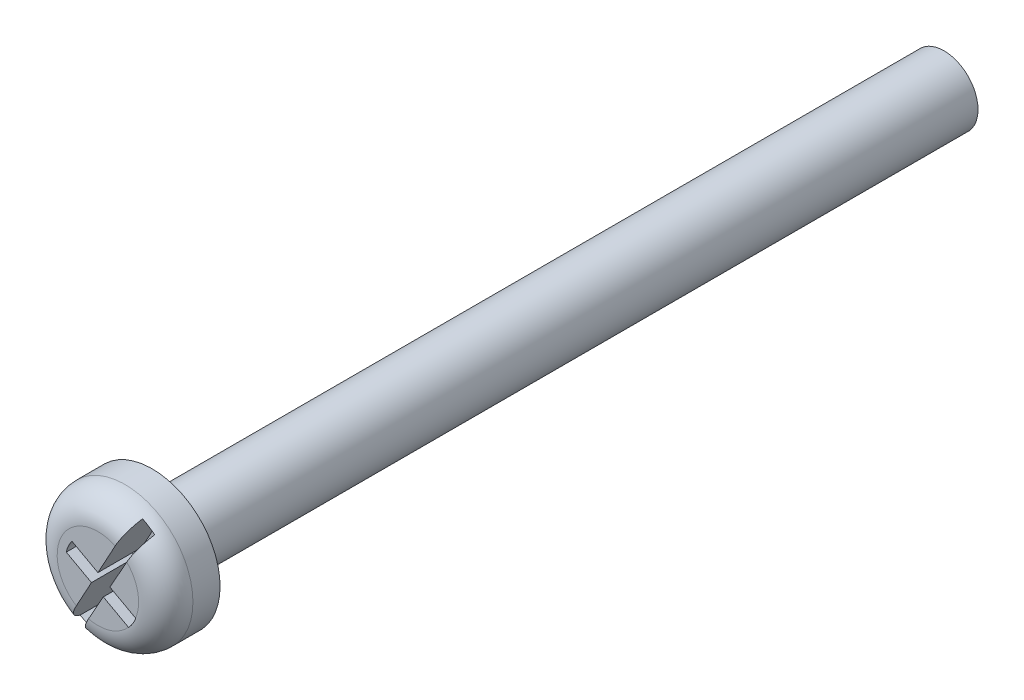
ISO-10303-21;
HEADER;
FILE_DESCRIPTION(('STEP AP214'),'2;1');
FILE_NAME('part.step','',(''),(''),'','','');
FILE_SCHEMA(('AUTOMOTIVE_DESIGN { 1 0 10303 214 1 1 1 1 }'));
ENDSEC;
DATA;
#1=APPLICATION_CONTEXT('core data for automotive mechanical design processes');
#2=APPLICATION_PROTOCOL_DEFINITION('international standard','automotive_design',2000,#1);
#3=PRODUCT_CONTEXT('',#1,'mechanical');
#4=PRODUCT('Part','Part','',(#3));
#5=PRODUCT_RELATED_PRODUCT_CATEGORY('part','',(#4));
#6=PRODUCT_DEFINITION_FORMATION('','',#4);
#7=PRODUCT_DEFINITION_CONTEXT('part definition',#1,'design');
#8=PRODUCT_DEFINITION('design','',#6,#7);
#9=PRODUCT_DEFINITION_SHAPE('','',#8);
#10=(LENGTH_UNIT() NAMED_UNIT(*) SI_UNIT(.MILLI.,.METRE.));
#11=(NAMED_UNIT(*) PLANE_ANGLE_UNIT() SI_UNIT($,.RADIAN.));
#12=(NAMED_UNIT(*) SI_UNIT($,.STERADIAN.) SOLID_ANGLE_UNIT());
#13=UNCERTAINTY_MEASURE_WITH_UNIT(LENGTH_MEASURE(1.E-05),#10,'distance_accuracy_value','');
#14=(GEOMETRIC_REPRESENTATION_CONTEXT(3) GLOBAL_UNCERTAINTY_ASSIGNED_CONTEXT((#13)) GLOBAL_UNIT_ASSIGNED_CONTEXT((#10,
#11,#12)) REPRESENTATION_CONTEXT('',''));
#15=CARTESIAN_POINT('',(0.,0.,0.));
#16=DIRECTION('',(0.,0.,1.));
#17=DIRECTION('',(1.,0.,0.));
#18=AXIS2_PLACEMENT_3D('',#15,#16,#17);
#19=CARTESIAN_POINT('',(-1.86051624597212,2.73214285714287,2.4));
#20=DIRECTION('',(0.,0.,1.));
#21=DIRECTION('',(1.,0.,0.));
#22=AXIS2_PLACEMENT_3D('',#19,#20,#21);
#23=PLANE('',#22);
#24=DIRECTION('',(-0.478292119632489,-0.87820080180871,0.));
#25=VECTOR('',#24,1.);
#26=CARTESIAN_POINT('',(-3.33454353016391,0.250826496084395,2.4));
#27=LINE('',#26,#25);
#28=CARTESIAN_POINT('',(-2.14514294385762,2.43470640062586,2.4));
#29=VERTEX_POINT('',#28);
#30=CARTESIAN_POINT('',(-2.8144800366458,1.20572447213714,2.4));
#31=VERTEX_POINT('',#30);
#32=EDGE_CURVE('E165',#29,#31,#27,.T.);
#33=ORIENTED_EDGE('',*,*,#32,.F.);
#34=DIRECTION('',(0.877616803209732,-0.479362854968896,0.));
#35=VECTOR('',#34,1.);
#36=CARTESIAN_POINT('',(-2.14514294385762,2.43470640062586,2.4));
#37=LINE('',#36,#35);
#38=CARTESIAN_POINT('',(-3.25868789679237,3.04293551135249,2.4));
#39=VERTEX_POINT('',#38);
#40=EDGE_CURVE('E167',#39,#29,#37,.T.);
#41=ORIENTED_EDGE('',*,*,#40,.F.);
#42=CARTESIAN_POINT('',(-1.86051624597212,2.73214285714287,2.4));
#43=DIRECTION('',(0.,0.,1.));
#44=DIRECTION('',(1.,0.,0.));
#45=AXIS2_PLACEMENT_3D('',#42,#43,#44);
#46=CIRCLE('',#45,1.43229746877807);
#47=CARTESIAN_POINT('',(-3.00946383602339,3.58735948138695,2.4));
#48=VERTEX_POINT('',#47);
#49=EDGE_CURVE('E208',#48,#39,#46,.T.);
#50=ORIENTED_EDGE('',*,*,#49,.F.);
#51=DIRECTION('',(-0.87756139574922,0.479464280933086,0.));
#52=VECTOR('',#51,1.);
#53=CARTESIAN_POINT('',(-1.85954831796557,2.95909185285404,2.4));
#54=LINE('',#53,#52);
#55=CARTESIAN_POINT('',(-1.85954831796557,2.95909185285404,2.4));
#56=VERTEX_POINT('',#55);
#57=EDGE_CURVE('E205',#56,#48,#54,.T.);
#58=ORIENTED_EDGE('',*,*,#57,.F.);
#59=DIRECTION('',(-0.478292119632489,-0.87820080180871,0.));
#60=VECTOR('',#59,1.);
#61=CARTESIAN_POINT('',(-1.85954831796557,2.95909185285404,2.4));
#62=LINE('',#61,#60);
#63=CARTESIAN_POINT('',(-1.09571318629089,4.36158333776873,2.4));
#64=VERTEX_POINT('',#63);
#65=EDGE_CURVE('E203',#64,#56,#62,.T.);
#66=ORIENTED_EDGE('',*,*,#65,.F.);
#67=CARTESIAN_POINT('',(-1.86051624597212,2.73214285714287,2.4));
#68=DIRECTION('',(0.,0.,1.));
#69=DIRECTION('',(1.,0.,0.));
#70=AXIS2_PLACEMENT_3D('',#67,#68,#69);
#71=CIRCLE('',#70,1.8);
#72=EDGE_CURVE('E253',#64,#31,#71,.T.);
#73=ORIENTED_EDGE('',*,*,#72,.T.);
#74=EDGE_LOOP('',(#33,#41,#50,#58,#66,#73));
#75=FACE_BOUND('',#74,.T.);
#76=ADVANCED_FACE('F33',(#75),#23,.T.);
#77=DIRECTION('',(0.488945551082672,0.872314305784596,0.));
#78=VECTOR('',#77,1.);
#79=CARTESIAN_POINT('',(-1.32937302466549,2.66942537823253,2.4));
#80=LINE('',#79,#78);
#81=CARTESIAN_POINT('',(-1.32937302466549,2.66942537823253,2.4));
#82=VERTEX_POINT('',#81);
#83=CARTESIAN_POINT('',(-0.583292168991765,4.00048770661469,2.4));
#84=VERTEX_POINT('',#83);
#85=EDGE_CURVE('E201',#82,#84,#80,.T.);
#86=ORIENTED_EDGE('',*,*,#85,.F.);
#87=DIRECTION('',(-0.87756139574922,0.479464280933086,0.));
#88=VECTOR('',#87,1.);
#89=CARTESIAN_POINT('',(-0.183967514701797,2.04362183688296,2.4));
#90=LINE('',#89,#88);
#91=CARTESIAN_POINT('',(-0.194936591049152,2.04961489939557,2.4));
#92=VERTEX_POINT('',#91);
#93=EDGE_CURVE('E199',#92,#82,#90,.T.);
#94=ORIENTED_EDGE('',*,*,#93,.F.);
#95=EDGE_CURVE('E249',#92,#84,#71,.T.);
#96=ORIENTED_EDGE('',*,*,#95,.T.);
#97=EDGE_LOOP('',(#86,#94,#96));
#98=FACE_BOUND('',#97,.T.);
#99=ADVANCED_FACE('F288',(#98),#23,.T.);
#100=CARTESIAN_POINT('',(-1.86051624597212,2.73214285714287,2.4));
#101=DIRECTION('',(0.,0.,-1.));
#102=DIRECTION('',(-1.,0.,0.));
#103=AXIS2_PLACEMENT_3D('',#100,#101,#102);
#104=CYLINDRICAL_SURFACE('',#103,3.);
#105=CARTESIAN_POINT('',(-1.86051624597212,2.73214285714287,1.2));
#106=DIRECTION('',(0.,0.,1.));
#107=DIRECTION('',(1.,0.,0.));
#108=AXIS2_PLACEMENT_3D('',#105,#106,#107);
#109=CIRCLE('',#108,3.);
#110=CARTESIAN_POINT('',(1.13948375402788,2.73214285714287,1.2));
#111=VERTEX_POINT('',#110);
#112=EDGE_CURVE('E254',#111,#111,#109,.F.);
#113=ORIENTED_EDGE('',*,*,#112,.T.);
#114=EDGE_LOOP('',(#113));
#115=FACE_BOUND('',#114,.T.);
#116=CARTESIAN_POINT('',(-1.86051624597212,2.73214285714287,0.));
#117=DIRECTION('',(0.,0.,1.));
#118=DIRECTION('',(1.,0.,0.));
#119=AXIS2_PLACEMENT_3D('',#116,#117,#118);
#120=CIRCLE('',#119,3.);
#121=CARTESIAN_POINT('',(1.13948375402788,2.73214285714287,0.));
#122=VERTEX_POINT('',#121);
#123=EDGE_CURVE('E243',#122,#122,#120,.T.);
#124=ORIENTED_EDGE('',*,*,#123,.T.);
#125=EDGE_LOOP('',(#124));
#126=FACE_BOUND('',#125,.T.);
#127=ADVANCED_FACE('F286',(#115,#126),#104,.T.);
#128=DIRECTION('',(0.877616803209732,-0.479362854968895,0.));
#129=VECTOR('',#128,1.);
#130=CARTESIAN_POINT('',(-0.499159615510704,1.53565425779784,2.4));
#131=LINE('',#130,#129);
#132=CARTESIAN_POINT('',(-1.62131210840641,2.14858489077753,2.4));
#133=VERTEX_POINT('',#132);
#134=CARTESIAN_POINT('',(-0.510336160729363,1.54175899577131,2.4));
#135=VERTEX_POINT('',#134);
#136=EDGE_CURVE('E197',#133,#135,#131,.T.);
#137=ORIENTED_EDGE('',*,*,#136,.F.);
#138=DIRECTION('',(0.488945551082672,0.872314305784596,0.));
#139=VECTOR('',#138,1.);
#140=CARTESIAN_POINT('',(-2.81993360779638,0.0101572502690064,2.4));
#141=LINE('',#140,#139);
#142=CARTESIAN_POINT('',(-2.27591252151725,0.980730303155878,2.4));
#143=VERTEX_POINT('',#142);
#144=EDGE_CURVE('E195',#143,#133,#141,.T.);
#145=ORIENTED_EDGE('',*,*,#144,.F.);
#146=EDGE_CURVE('E252',#143,#135,#71,.T.);
#147=ORIENTED_EDGE('',*,*,#146,.T.);
#148=EDGE_LOOP('',(#137,#145,#147));
#149=FACE_BOUND('',#148,.T.);
#150=ADVANCED_FACE('F283',(#149),#23,.T.);
#151=CARTESIAN_POINT('',(-1.86051624597212,2.73214285714287,0.));
#152=DIRECTION('',(0.,0.,1.));
#153=DIRECTION('',(1.,0.,0.));
#154=AXIS2_PLACEMENT_3D('',#151,#152,#153);
#155=PLANE('',#154);
#156=CARTESIAN_POINT('',(-1.86051624597212,2.73214285714287,0.));
#157=DIRECTION('',(0.,0.,1.));
#158=DIRECTION('',(1.,0.,0.));
#159=AXIS2_PLACEMENT_3D('',#156,#157,#158);
#160=CIRCLE('',#159,1.5);
#161=CARTESIAN_POINT('',(-0.360516245972119,2.73214285714287,0.));
#162=VERTEX_POINT('',#161);
#163=EDGE_CURVE('E246',#162,#162,#160,.F.);
#164=ORIENTED_EDGE('',*,*,#163,.F.);
#165=EDGE_LOOP('',(#164));
#166=FACE_BOUND('',#165,.T.);
#167=ORIENTED_EDGE('',*,*,#123,.F.);
#168=EDGE_LOOP('',(#167));
#169=FACE_BOUND('',#168,.T.);
#170=ADVANCED_FACE('F281',(#166,#169),#155,.F.);
#171=CARTESIAN_POINT('',(-1.86051624597212,2.73214285714287,-35.));
#172=DIRECTION('',(0.,0.,1.));
#173=DIRECTION('',(1.,0.,0.));
#174=AXIS2_PLACEMENT_3D('',#171,#172,#173);
#175=CYLINDRICAL_SURFACE('',#174,1.5);
#176=CARTESIAN_POINT('',(-1.86051624597212,2.73214285714287,-35.));
#177=DIRECTION('',(0.,0.,-1.));
#178=DIRECTION('',(-1.,0.,0.));
#179=AXIS2_PLACEMENT_3D('',#176,#177,#178);
#180=CIRCLE('',#179,1.5);
#181=CARTESIAN_POINT('',(-3.36051624597212,2.73214285714287,-35.));
#182=VERTEX_POINT('',#181);
#183=EDGE_CURVE('E215',#182,#182,#180,.T.);
#184=ORIENTED_EDGE('',*,*,#183,.F.);
#185=EDGE_LOOP('',(#184));
#186=FACE_BOUND('',#185,.T.);
#187=ORIENTED_EDGE('',*,*,#163,.T.);
#188=EDGE_LOOP('',(#187));
#189=FACE_BOUND('',#188,.T.);
#190=ADVANCED_FACE('F277',(#186,#189),#175,.T.);
#191=CARTESIAN_POINT('',(-1.86051624597212,2.73214285714287,-35.));
#192=DIRECTION('',(0.,0.,-1.));
#193=DIRECTION('',(-1.,0.,0.));
#194=AXIS2_PLACEMENT_3D('',#191,#192,#193);
#195=PLANE('',#194);
#196=ORIENTED_EDGE('',*,*,#183,.T.);
#197=EDGE_LOOP('',(#196));
#198=FACE_BOUND('',#197,.T.);
#199=ADVANCED_FACE('F274',(#198),#195,.T.);
#200=CARTESIAN_POINT('',(-1.86051624597212,2.73214285714287,1.2));
#201=DIRECTION('',(0.,0.,1.));
#202=DIRECTION('',(1.,0.,0.));
#203=AXIS2_PLACEMENT_3D('',#200,#201,#202);
#204=TOROIDAL_SURFACE('',#203,1.8,1.2);
#205=CARTESIAN_POINT('',(-0.575540767315494,5.31668131382147,1.70975429270533));
#206=CARTESIAN_POINT('',(-0.5824043740871,5.3040789214284,1.74031456902629));
#207=CARTESIAN_POINT('',(-0.58988200536983,5.29034910753732,1.77025412843296));
#208=CARTESIAN_POINT('',(-0.606016263850412,5.26072470405536,1.82870871238285));
#209=CARTESIAN_POINT('',(-0.614672831189766,5.24483022437174,1.85722380915036));
#210=CARTESIAN_POINT('',(-0.642308509018158,5.19408785703759,1.94027220578123));
#211=CARTESIAN_POINT('',(-0.6629762437161,5.15613945596996,1.99240919048908));
#212=CARTESIAN_POINT('',(-0.708203159379022,5.07309749903989,2.08868631517981));
#213=CARTESIAN_POINT('',(-0.732764089691729,5.02800073116848,2.1328228410772));
#214=CARTESIAN_POINT('',(-0.785077689775711,4.931946784943,2.21185265354796));
#215=CARTESIAN_POINT('',(-0.812829752078776,4.88099072197227,2.24674769517889));
#216=CARTESIAN_POINT('',(-0.870755055483799,4.77463302589651,2.30632883547805));
#217=CARTESIAN_POINT('',(-0.900929651552919,4.71922890491179,2.33100917270618));
#218=CARTESIAN_POINT('',(-0.96283568336023,4.6055621214997,2.3694469225507));
#219=CARTESIAN_POINT('',(-0.994567368093604,4.54729900188777,2.38320258211041));
#220=CARTESIAN_POINT('',(-1.05872386347642,4.42950010164723,2.39941483191493));
#221=CARTESIAN_POINT('',(-1.09114948115231,4.36996283922278,2.40185745763308));
#222=CARTESIAN_POINT('',(-1.15573526747496,4.25137571013191,2.3953503202161));
#223=CARTESIAN_POINT('',(-1.18789545531375,4.19232580822668,2.38640138814567));
#224=CARTESIAN_POINT('',(-1.25111142223883,4.07625382927923,2.35735083248507));
#225=CARTESIAN_POINT('',(-1.28216478936063,4.01923618088856,2.33722626866415));
#226=CARTESIAN_POINT('',(-1.34222441899033,3.90895960987239,2.28639254421336));
#227=CARTESIAN_POINT('',(-1.37123050343914,3.85570101418436,2.25568246428877));
#228=CARTESIAN_POINT('',(-1.42645974489832,3.75429360615512,2.18445449366384));
#229=CARTESIAN_POINT('',(-1.45267457095233,3.7061600904334,2.14390836466459));
#230=CARTESIAN_POINT('',(-1.50148430909094,3.6165396484275,2.05421363754392));
#231=CARTESIAN_POINT('',(-1.52407946375269,3.57505227674305,2.00506561635217));
#232=CARTESIAN_POINT('',(-1.56505668794341,3.49981325510113,1.89942416088343));
#233=CARTESIAN_POINT('',(-1.58342918956016,3.46607917296016,1.84291449103487));
#234=CARTESIAN_POINT('',(-1.61535277583557,3.40746369945995,1.72423224566163));
#235=CARTESIAN_POINT('',(-1.62890390546596,3.38258222552731,1.66205972296445));
#236=CARTESIAN_POINT('',(-1.65068064383632,3.3425975627812,1.53419605152068));
#237=CARTESIAN_POINT('',(-1.65894166858414,3.32742934599587,1.46853155927476));
#238=CARTESIAN_POINT('',(-1.66723338993673,3.31220476661996,1.36857431614967));
#239=CARTESIAN_POINT('',(-1.66931401785529,3.30838448810952,1.33497508943135));
#240=CARTESIAN_POINT('',(-1.67209007621539,3.30328731720154,1.26752282072818));
#241=CARTESIAN_POINT('',(-1.67278531621524,3.30201077447743,1.23366974448996));
#242=CARTESIAN_POINT('',(-1.67278220669648,3.302016483921,1.1998));
#243=B_SPLINE_CURVE_WITH_KNOTS('',3,(#205,#206,#207,#208,#209,#210,#211,#212,#213,#214,#215,
#216,#217,#218,#219,#220,#221,#222,#223,#224,#225,#226,#227,#228,#229,#230,#231,#232,#233,#234,
#235,#236,#237,#238,#239,#240,#241,#242),.UNSPECIFIED.,.F.,.F.,(4,2,2,2,2,2,2,2,2,2,2,2,2,2,2,2,
2,2,4),(0.,0.101223158894359,0.202441180267574,0.404547966509414,0.606745825117994,
0.808905256591363,1.01117855796459,1.21348431109243,1.41603971895592,1.61858035035038,
1.82153828216889,2.02451384422666,2.22807917195367,2.43163085176484,2.63563930015266,
2.83964584558596,3.04227192850753,3.1438024334223,3.24534689421735),.UNSPECIFIED.);
#244=CARTESIAN_POINT('',(-0.575649692772779,5.31648131382147,1.71023901109821));
#245=VERTEX_POINT('',#244);
#246=EDGE_CURVE('E11',#245,#64,#243,.T.);
#247=ORIENTED_EDGE('',*,*,#246,.F.);
#248=CARTESIAN_POINT('',(-1.86051624597212,2.73214285714287,1.71023901109821));
#249=DIRECTION('',(0.,0.,-1.));
#250=DIRECTION('',(-1.,0.,0.));
#251=AXIS2_PLACEMENT_3D('',#248,#249,#250);
#252=CIRCLE('',#251,2.88611976851244);
#253=CARTESIAN_POINT('',(-0.0392710827126332,4.97106075950156,1.71023901109827));
#254=VERTEX_POINT('',#253);
#255=EDGE_CURVE('E46',#254,#245,#252,.F.);
#256=ORIENTED_EDGE('',*,*,#255,.F.);
#257=CARTESIAN_POINT('',(-1.26309170389054,2.78767605909107,1.1998));
#258=CARTESIAN_POINT('',(-1.2631127720155,2.78763847202896,1.22576998040815));
#259=CARTESIAN_POINT('',(-1.26237301012876,2.78895826085872,1.25170198029709));
#260=CARTESIAN_POINT('',(-1.25952072671015,2.79404694123365,1.30315668634531));
#261=CARTESIAN_POINT('',(-1.25741325248622,2.79780682801559,1.32868054522842));
#262=CARTESIAN_POINT('',(-1.24932506804159,2.81223673536059,1.40375196214292));
#263=CARTESIAN_POINT('',(-1.24157094586872,2.8260706513973,1.45250594024511));
#264=CARTESIAN_POINT('',(-1.22556622491573,2.8546242337266,1.53282213605265));
#265=CARTESIAN_POINT('',(-1.21816574900715,2.86782721919272,1.56514626066184));
#266=CARTESIAN_POINT('',(-1.20205095375697,2.89657718204726,1.62840310857575));
#267=CARTESIAN_POINT('',(-1.19333633706057,2.9121246899382,1.65933551490998));
#268=CARTESIAN_POINT('',(-1.16542086668087,2.96192791263038,1.75044821489817));
#269=CARTESIAN_POINT('',(-1.14454383968645,2.99917404212099,1.80849742576797));
#270=CARTESIAN_POINT('',(-1.09772220899005,3.08270722528668,1.92199684801045));
#271=CARTESIAN_POINT('',(-1.07153445687538,3.12942807335531,1.9770243073677));
#272=CARTESIAN_POINT('',(-1.01564250198845,3.22914337236595,2.07869204050147));
#273=CARTESIAN_POINT('',(-0.985948470618887,3.28211967678826,2.12535563158695));
#274=CARTESIAN_POINT('',(-0.918223441287482,3.40294603836298,2.21601487520697));
#275=CARTESIAN_POINT('',(-0.879627663676285,3.47180370334956,2.25827105625763));
#276=CARTESIAN_POINT('',(-0.799196938468586,3.61529794737724,2.32733623557769));
#277=CARTESIAN_POINT('',(-0.75735970921051,3.68993859706798,2.35413423868104));
#278=CARTESIAN_POINT('',(-0.676058999745624,3.83498495607384,2.38861679562639));
#279=CARTESIAN_POINT('',(-0.636757731729013,3.90510126708322,2.39790034547785));
#280=CARTESIAN_POINT('',(-0.558000185780485,4.04561043802723,2.40146077706672));
#281=CARTESIAN_POINT('',(-0.518544054122394,4.11600303699876,2.39574945908726));
#282=CARTESIAN_POINT('',(-0.444261504767299,4.24852848963682,2.3702843287041));
#283=CARTESIAN_POINT('',(-0.409330772893901,4.31084744735557,2.35179428040256));
#284=CARTESIAN_POINT('',(-0.341616033942729,4.43165545014603,2.30246954631037));
#285=CARTESIAN_POINT('',(-0.308831410977736,4.49014559400518,2.27163842037526));
#286=CARTESIAN_POINT('',(-0.248009519737374,4.59865625683126,2.20022273119116));
#287=CARTESIAN_POINT('',(-0.219819428476118,4.64894942308283,2.16018125447389));
#288=CARTESIAN_POINT('',(-0.167249114151315,4.74273867455178,2.0707446602969));
#289=CARTESIAN_POINT('',(-0.142866729021386,4.78623861705231,2.02135488642782));
#290=CARTESIAN_POINT('',(-0.10452820364559,4.85463732540325,1.92879061961627));
#291=CARTESIAN_POINT('',(-0.08951899805589,4.88141483616159,1.88741844310844));
#292=CARTESIAN_POINT('',(-0.0622349441551543,4.93009156608522,1.80110482457957));
#293=CARTESIAN_POINT('',(-0.0499580968395804,4.95199435161951,1.75616602478609));
#294=CARTESIAN_POINT('',(-0.0391589796443221,4.97126075950155,1.70975788936457));
#295=B_SPLINE_CURVE_WITH_KNOTS('',3,(#257,#258,#259,#260,#261,#262,#263,#264,#265,#266,#267,
#268,#269,#270,#271,#272,#273,#274,#275,#276,#277,#278,#279,#280,#281,#282,#283,#284,#285,#286,
#287,#288,#289,#290,#291,#292,#293,#294),.UNSPECIFIED.,.F.,.F.,(4,2,2,2,2,2,2,2,2,2,2,2,2,2,2,2,
2,2,4),(0.,0.0778006917118378,0.155315893483458,0.308266870217621,0.415234357270093,
0.522226084613864,0.737655839714488,0.967269406588131,1.19623253348757,1.46333863997643,
1.73063450143458,1.97205770050909,2.21329096739737,2.43355558113201,2.65375670399323,
2.86332090395877,3.07276567449364,3.22690773757732,3.38093665626108),.UNSPECIFIED.);
#296=EDGE_CURVE('E354',#84,#254,#295,.T.);
#297=ORIENTED_EDGE('',*,*,#296,.F.);
#298=ORIENTED_EDGE('',*,*,#95,.F.);
#299=CARTESIAN_POINT('',(-0.183767514701797,2.04351256492016,2.39993332802436));
#300=CARTESIAN_POINT('',(-0.217782658736837,2.06209707268747,2.40033863472729));
#301=CARTESIAN_POINT('',(-0.251792157132213,2.08067849590415,2.39888813616958));
#302=CARTESIAN_POINT('',(-0.319534364168039,2.11769011553849,2.39230484226138));
#303=CARTESIAN_POINT('',(-0.353267082920302,2.13612031748085,2.38717218204555));
#304=CARTESIAN_POINT('',(-0.453400795391146,2.19082935399903,2.36634775777888));
#305=CARTESIAN_POINT('',(-0.519000364428353,2.22667032233503,2.34523208484704));
#306=CARTESIAN_POINT('',(-0.638425774554932,2.29191956719567,2.2925053228282));
#307=CARTESIAN_POINT('',(-0.69274889876274,2.32159953923238,2.26232665392895));
#308=CARTESIAN_POINT('',(-0.796253299526463,2.37815018437923,2.19212147821412));
#309=CARTESIAN_POINT('',(-0.845435603131863,2.40502141862793,2.1520969438157));
#310=CARTESIAN_POINT('',(-0.93783514695995,2.45550481620521,2.0628344484937));
#311=CARTESIAN_POINT('',(-0.980978593060597,2.47907666139099,2.01349735883978));
#312=CARTESIAN_POINT('',(-1.05943191653211,2.5219404046086,1.90725218211608));
#313=CARTESIAN_POINT('',(-1.09473743753789,2.5412299224976,1.85033991268358));
#314=CARTESIAN_POINT('',(-1.15640863612218,2.57492458708373,1.73042207813507));
#315=CARTESIAN_POINT('',(-1.18276106492887,2.58932249518434,1.66740765860267));
#316=CARTESIAN_POINT('',(-1.22535753184498,2.61259549292461,1.53714360818663));
#317=CARTESIAN_POINT('',(-1.24161903914605,2.62148012702857,1.46990151973345));
#318=CARTESIAN_POINT('',(-1.25768366139594,2.6302571910526,1.36830312947122));
#319=CARTESIAN_POINT('',(-1.26165056048128,2.63242454529892,1.33474662578359));
#320=CARTESIAN_POINT('',(-1.266942961413,2.63531610048746,1.26739967422531));
#321=CARTESIAN_POINT('',(-1.26827119793696,2.6360417955476,1.23360950501902));
#322=CARTESIAN_POINT('',(-1.26826312586215,2.63603738529031,1.1998));
#323=B_SPLINE_CURVE_WITH_KNOTS('',3,(#299,#300,#301,#302,#303,#304,#305,#306,#307,#308,#309,
#310,#311,#312,#313,#314,#315,#316,#317,#318,#319,#320,#321,#322),.UNSPECIFIED.,.F.,.F.,(4,2,2,
2,2,2,2,2,2,2,2,4),(0.,0.116194057201358,0.232383850320403,0.463878668865414,0.66956690126712,
0.875213961759851,1.08318799595766,1.29127733555275,1.49967327769664,1.70770743525587,
1.80916908072369,1.91052551761236),.UNSPECIFIED.);
#324=CARTESIAN_POINT('',(-0.183967514701797,2.04362183688296,2.39993569454367));
#325=VERTEX_POINT('',#324);
#326=EDGE_CURVE('E359',#325,#92,#323,.T.);
#327=ORIENTED_EDGE('',*,*,#326,.F.);
#328=CARTESIAN_POINT('',(-1.86051624597212,2.73214285714287,2.39993569454367));
#329=DIRECTION('',(0.,0.,-1.));
#330=DIRECTION('',(-1.,0.,0.));
#331=AXIS2_PLACEMENT_3D('',#328,#329,#330);
#332=CIRCLE('',#331,1.81242292075108);
#333=CARTESIAN_POINT('',(-0.499159615510704,1.53565425779784,2.39993569454353));
#334=VERTEX_POINT('',#333);
#335=EDGE_CURVE('E312',#334,#325,#332,.F.);
#336=ORIENTED_EDGE('',*,*,#335,.F.);
#337=CARTESIAN_POINT('',(-1.62151210840638,2.14869413272758,1.46884807485071));
#338=CARTESIAN_POINT('',(-1.61337014202699,2.14424691130428,1.50015816020714));
#339=CARTESIAN_POINT('',(-1.60395340171439,2.13910339592918,1.53100343533154));
#340=CARTESIAN_POINT('',(-1.58283284504561,2.12756714194424,1.59162369108894));
#341=CARTESIAN_POINT('',(-1.57113159541627,2.12117580530562,1.62139982889169));
#342=CARTESIAN_POINT('',(-1.53304521941817,2.10037265538062,1.70882633846756));
#343=CARTESIAN_POINT('',(-1.50362091999362,2.08430081613823,1.76478080452301));
#344=CARTESIAN_POINT('',(-1.43685873996878,2.0478346624552,1.87328351003643));
#345=CARTESIAN_POINT('',(-1.39926537871097,2.02730080198841,1.92562519772884));
#346=CARTESIAN_POINT('',(-1.31781577832807,1.98281223609858,2.02368680610002));
#347=CARTESIAN_POINT('',(-1.27395030371921,1.95885248616424,2.06939675818379));
#348=CARTESIAN_POINT('',(-1.17347767984285,1.90397335936148,2.15971584324997));
#349=CARTESIAN_POINT('',(-1.11595236120694,1.87255246943155,2.2030105340935));
#350=CARTESIAN_POINT('',(-0.99525776678779,1.80662790514737,2.27762475239334));
#351=CARTESIAN_POINT('',(-0.93209357834735,1.77212700954936,2.30895494207597));
#352=CARTESIAN_POINT('',(-0.807854099588225,1.70426619487488,2.35608316652604));
#353=CARTESIAN_POINT('',(-0.747121541030133,1.67109347922781,2.37304527651785));
#354=CARTESIAN_POINT('',(-0.654777795629045,1.6206544251075,2.38976872479177));
#355=CARTESIAN_POINT('',(-0.623736747104048,1.6036995017426,2.39388947843407));
#356=CARTESIAN_POINT('',(-0.561450947954723,1.56967839093998,2.39915564694617));
#357=CARTESIAN_POINT('',(-0.530206133741795,1.55261216876954,2.40030008361231));
#358=CARTESIAN_POINT('',(-0.498959615510704,1.53554501584778,2.39993337202856));
#359=B_SPLINE_CURVE_WITH_KNOTS('',3,(#337,#338,#339,#340,#341,#342,#343,#344,#345,#346,#347,
#348,#349,#350,#351,#352,#353,#354,#355,#356,#357,#358),.UNSPECIFIED.,.F.,.F.,(4,2,2,2,2,2,2,2,
2,2,4),(0.,0.0978774872130326,0.195645631969167,0.390542213792294,0.592750808490968,
0.795260275068813,1.02975854366474,1.26404734754404,1.47677448793309,1.58349124104491,
1.69024306351729),.UNSPECIFIED.);
#360=EDGE_CURVE('E311',#135,#334,#359,.T.);
#361=ORIENTED_EDGE('',*,*,#360,.F.);
#362=ORIENTED_EDGE('',*,*,#146,.F.);
#363=CARTESIAN_POINT('',(-2.8200457108647,0.00995725026900685,1.70975788936454));
#364=CARTESIAN_POINT('',(-2.81294284402451,0.022629279584052,1.74025937821588));
#365=CARTESIAN_POINT('',(-2.80520776699475,0.0364292177048946,1.77012651441064));
#366=CARTESIAN_POINT('',(-2.78852805075133,0.0661870405613481,1.82840858711255));
#367=CARTESIAN_POINT('',(-2.77958354431484,0.0821446884128344,1.85682368256077));
#368=CARTESIAN_POINT('',(-2.75105867197416,0.133035128377685,1.93950073195886));
#369=CARTESIAN_POINT('',(-2.72975432624299,0.171043625470118,1.99133402140313));
#370=CARTESIAN_POINT('',(-2.68321245334617,0.254077700442272,2.08695288085192));
#371=CARTESIAN_POINT('',(-2.65797425673365,0.299104472663766,2.13073707832536));
#372=CARTESIAN_POINT('',(-2.60429647966901,0.394869517938271,2.20913797564933));
#373=CARTESIAN_POINT('',(-2.57585694671416,0.445607706252732,2.24375481148769));
#374=CARTESIAN_POINT('',(-2.51624584523596,0.551958232375456,2.30332144687179));
#375=CARTESIAN_POINT('',(-2.48504637325386,0.607620351976805,2.32815425531122));
#376=CARTESIAN_POINT('',(-2.42108372755138,0.721734348430112,2.36706399353599));
#377=CARTESIAN_POINT('',(-2.38832028354668,0.780186707488876,2.38113905697485));
#378=CARTESIAN_POINT('',(-2.3212205298552,0.899897531997037,2.39860255480028));
#379=CARTESIAN_POINT('',(-2.28686565282517,0.961189122932676,2.40169129859643));
#380=CARTESIAN_POINT('',(-2.21836196694208,1.08340466423881,2.39656212253163));
#381=CARTESIAN_POINT('',(-2.18421320380919,1.14432853304119,2.38834178043095));
#382=CARTESIAN_POINT('',(-2.11541314916736,1.26707281769608,2.36052733205186));
#383=CARTESIAN_POINT('',(-2.08081091742779,1.32880570736378,2.34042775974803));
#384=CARTESIAN_POINT('',(-2.01358345624662,1.4487443712908,2.28946888113319));
#385=CARTESIAN_POINT('',(-1.98095779999344,1.5069509070129,2.25861190751046));
#386=CARTESIAN_POINT('',(-1.91595930201837,1.6229129390073,2.1846794657163));
#387=CARTESIAN_POINT('',(-1.88378883195749,1.68030738956684,2.14086134133571));
#388=CARTESIAN_POINT('',(-1.82299040998259,1.78877618152209,2.04373589253331));
#389=CARTESIAN_POINT('',(-1.79437078554514,1.83983566609596,1.99040695083443));
#390=CARTESIAN_POINT('',(-1.74170793806781,1.93379000341657,1.87684814417621));
#391=CARTESIAN_POINT('',(-1.71758927738487,1.97681944238683,1.81676563764669));
#392=CARTESIAN_POINT('',(-1.68499473938053,2.03497046089731,1.72173769517997));
#393=CARTESIAN_POINT('',(-1.67474067883886,2.05326444819932,1.68930008901254));
#394=CARTESIAN_POINT('',(-1.65560220426437,2.0874088741487,1.62278687505944));
#395=CARTESIAN_POINT('',(-1.64671642517575,2.10326174815456,1.58871294486205));
#396=CARTESIAN_POINT('',(-1.6354763758506,2.12331481091859,1.53995134726292));
#397=CARTESIAN_POINT('',(-1.63241040549437,2.12878472427997,1.52594181495768));
#398=CARTESIAN_POINT('',(-1.62657512176459,2.13919529344156,1.49766364899058));
#399=CARTESIAN_POINT('',(-1.62380587038182,2.14413583864574,1.48339496191127));
#400=CARTESIAN_POINT('',(-1.6212000053383,2.14878489077715,1.46899770049256));
#401=B_SPLINE_CURVE_WITH_KNOTS('',3,(#363,#364,#365,#366,#367,#368,#369,#370,#371,#372,#373,
#374,#375,#376,#377,#378,#379,#380,#381,#382,#383,#384,#385,#386,#387,#388,#389,#390,#391,#392,
#393,#394,#395,#396,#397,#398,#399,#400),.UNSPECIFIED.,.F.,.F.,(4,2,2,2,2,2,2,2,2,2,2,2,2,2,2,2,
2,2,4),(0.,0.101288992601227,0.202566874207223,0.404664504390113,0.606796564357891,
0.808925625748703,1.01340315711687,1.21791615496524,1.42796691929092,1.63806268040327,
1.85781625970006,2.07752221615008,2.31370147648449,2.5504245572661,2.78272989816584,
2.89851304910329,3.0141799308455,3.06021461907438,3.10625890623177),.UNSPECIFIED.);
#402=CARTESIAN_POINT('',(-2.81993360779156,0.0101572502776019,1.71023901111888));
#403=VERTEX_POINT('',#402);
#404=EDGE_CURVE('E257',#403,#143,#401,.T.);
#405=ORIENTED_EDGE('',*,*,#404,.F.);
#406=CARTESIAN_POINT('',(-1.86051624597212,2.73214285714287,1.71023901109822));
#407=DIRECTION('',(0.,0.,-1.));
#408=DIRECTION('',(-1.,0.,0.));
#409=AXIS2_PLACEMENT_3D('',#406,#407,#408);
#410=CIRCLE('',#409,2.88611976851244);
#411=CARTESIAN_POINT('',(-3.33454353016391,0.250826496084395,1.71023901109839));
#412=VERTEX_POINT('',#411);
#413=EDGE_CURVE('E148',#412,#403,#410,.F.);
#414=ORIENTED_EDGE('',*,*,#413,.F.);
#415=CARTESIAN_POINT('',(-2.23741101624021,2.26529132598487,1.1998));
#416=CARTESIAN_POINT('',(-2.23740798207602,2.26529689706855,1.23311773914182));
#417=CARTESIAN_POINT('',(-2.23808067093128,2.26406176090843,1.26641957114974));
#418=CARTESIAN_POINT('',(-2.24076710911818,2.25912914321957,1.33278175952951));
#419=CARTESIAN_POINT('',(-2.242780689134,2.25543197257465,1.36584214585618));
#420=CARTESIAN_POINT('',(-2.25080606757614,2.24069643022843,1.46421986667473));
#421=CARTESIAN_POINT('',(-2.25880259100748,2.22601386908886,1.52887702678378));
#422=CARTESIAN_POINT('',(-2.27983915454845,2.18738825471918,1.65459016266913));
#423=CARTESIAN_POINT('',(-2.29288843169437,2.16342824119987,1.71563930558337));
#424=CARTESIAN_POINT('',(-2.32363131516378,2.10698067745266,1.83240079175109));
#425=CARTESIAN_POINT('',(-2.34132519302719,2.07449262864539,1.88811282271796));
#426=CARTESIAN_POINT('',(-2.38115513632148,2.00136015018449,1.99348291171297));
#427=CARTESIAN_POINT('',(-2.40335437218142,1.96059973216481,2.04303659878605));
#428=CARTESIAN_POINT('',(-2.4513978021071,1.87238632251299,2.13371393052453));
#429=CARTESIAN_POINT('',(-2.47724247281079,1.82493245571732,2.17483647109585));
#430=CARTESIAN_POINT('',(-2.53202000366664,1.72435444168758,2.24770555401301));
#431=CARTESIAN_POINT('',(-2.5609706987514,1.67119754741156,2.27939351984365));
#432=CARTESIAN_POINT('',(-2.62100717148868,1.5609634951839,2.3321349510837));
#433=CARTESIAN_POINT('',(-2.65209280048278,1.50388661018668,2.35318915608555));
#434=CARTESIAN_POINT('',(-2.715459985346,1.38753697725104,2.38402091071262));
#435=CARTESIAN_POINT('',(-2.74773931345678,1.32826831973999,2.39381847050695));
#436=CARTESIAN_POINT('',(-2.81262891214323,1.20912335527922,2.40190903095553));
#437=CARTESIAN_POINT('',(-2.84523920539102,1.1492470067008,2.40020123807361));
#438=CARTESIAN_POINT('',(-2.90976172307835,1.03077604629428,2.3853359072085));
#439=CARTESIAN_POINT('',(-2.94167569398232,0.972178227751287,2.37221150496673));
#440=CARTESIAN_POINT('',(-3.00398675295645,0.857767766640874,2.33492525045804));
#441=CARTESIAN_POINT('',(-3.03438411411032,0.801954622659517,2.31076539327067));
#442=CARTESIAN_POINT('',(-3.09273596313708,0.6948137384616,2.2521514303079));
#443=CARTESIAN_POINT('',(-3.12069564895239,0.64347645420905,2.21771995706866));
#444=CARTESIAN_POINT('',(-3.1734523737464,0.546608878697876,2.13952114974382));
#445=CARTESIAN_POINT('',(-3.19824869151269,0.501079911670375,2.09575169275951));
#446=CARTESIAN_POINT('',(-3.2445007498667,0.416155671724698,1.99898020102851));
#447=CARTESIAN_POINT('',(-3.2658668259731,0.376925033380575,1.94578943219456));
#448=CARTESIAN_POINT('',(-3.29438735791881,0.324557969415617,1.86087349664456));
#449=CARTESIAN_POINT('',(-3.30331296750969,0.308169496393382,1.83168275144308));
#450=CARTESIAN_POINT('',(-3.31992520204965,0.277667472433556,1.77179737413023));
#451=CARTESIAN_POINT('',(-3.32761178275446,0.263554002733655,1.74110268836594));
#452=CARTESIAN_POINT('',(-3.3346524556212,0.250626496084396,1.70975429270533));
#453=B_SPLINE_CURVE_WITH_KNOTS('',3,(#415,#416,#417,#418,#419,#420,#421,#422,#423,#424,#425,
#426,#427,#428,#429,#430,#431,#432,#433,#434,#435,#436,#437,#438,#439,#440,#441,#442,#443,#444,
#445,#446,#447,#448,#449,#450,#451,#452),.UNSPECIFIED.,.F.,.F.,(4,2,2,2,2,2,2,2,2,2,2,2,2,2,2,2,
2,2,4),(0.,0.0998914587792622,0.199770306544799,0.39910369637716,0.59880322511113,
0.798514431593275,1.00124780839576,1.20400771705243,1.40800143848499,1.61198096992408,
1.81559733711599,2.01922774808509,2.22226910362057,2.42527376620348,2.62783439007704,
2.83044111327975,3.03769485368784,3.14152109707258,3.24535104714929),.UNSPECIFIED.);
#454=EDGE_CURVE('E61',#31,#412,#453,.T.);
#455=ORIENTED_EDGE('',*,*,#454,.F.);
#456=ORIENTED_EDGE('',*,*,#72,.F.);
#457=EDGE_LOOP('',(#247,#256,#297,#298,#327,#336,#361,#362,#405,#414,#455,#456));
#458=FACE_BOUND('',#457,.T.);
#459=ORIENTED_EDGE('',*,*,#112,.F.);
#460=EDGE_LOOP('',(#459));
#461=FACE_BOUND('',#460,.T.);
#462=ADVANCED_FACE('F35',(#458,#461),#204,.T.);
#463=CARTESIAN_POINT('',(-1.86051624597212,2.73214285714287,0.46));
#464=DIRECTION('',(0.,0.,1.));
#465=DIRECTION('',(1.,0.,0.));
#466=AXIS2_PLACEMENT_3D('',#463,#464,#465);
#467=CYLINDRICAL_SURFACE('',#466,2.88611976851244);
#468=ORIENTED_EDGE('',*,*,#413,.T.);
#469=DIRECTION('',(0.,0.,1.));
#470=VECTOR('',#469,1.);
#471=CARTESIAN_POINT('',(-2.81993360779638,0.0101572502690064,0.46));
#472=LINE('',#471,#470);
#473=CARTESIAN_POINT('',(-2.81993360779638,0.0101572502690064,0.46));
#474=VERTEX_POINT('',#473);
#475=EDGE_CURVE('E53',#474,#403,#472,.T.);
#476=ORIENTED_EDGE('',*,*,#475,.F.);
#477=CARTESIAN_POINT('',(-1.86051624597212,2.73214285714287,0.46));
#478=DIRECTION('',(0.,0.,1.));
#479=DIRECTION('',(1.,0.,0.));
#480=AXIS2_PLACEMENT_3D('',#477,#478,#479);
#481=CIRCLE('',#480,2.88611976851244);
#482=CARTESIAN_POINT('',(-3.33454353016391,0.250826496084395,0.46));
#483=VERTEX_POINT('',#482);
#484=EDGE_CURVE('E145',#483,#474,#481,.T.);
#485=ORIENTED_EDGE('',*,*,#484,.F.);
#486=DIRECTION('',(0.,0.,1.));
#487=VECTOR('',#486,1.);
#488=CARTESIAN_POINT('',(-3.33454353016391,0.250826496084395,0.46));
#489=LINE('',#488,#487);
#490=EDGE_CURVE('E213',#483,#412,#489,.T.);
#491=ORIENTED_EDGE('',*,*,#490,.T.);
#492=EDGE_LOOP('',(#468,#476,#485,#491));
#493=FACE_BOUND('',#492,.T.);
#494=ADVANCED_FACE('F143',(#493),#467,.F.);
#495=CARTESIAN_POINT('',(-3.33454353016391,0.250826496084395,0.46));
#496=DIRECTION('',(-0.87820080180871,0.478292119632489,0.));
#497=DIRECTION('',(-0.478292119632489,-0.87820080180871,0.));
#498=AXIS2_PLACEMENT_3D('',#495,#496,#497);
#499=PLANE('',#498);
#500=ORIENTED_EDGE('',*,*,#454,.T.);
#501=ORIENTED_EDGE('',*,*,#490,.F.);
#502=DIRECTION('',(-0.478292119632489,-0.87820080180871,0.));
#503=VECTOR('',#502,1.);
#504=CARTESIAN_POINT('',(-3.33454353016391,0.250826496084395,0.46));
#505=LINE('',#504,#503);
#506=CARTESIAN_POINT('',(-2.14514294385762,2.43470640062586,0.46));
#507=VERTEX_POINT('',#506);
#508=EDGE_CURVE('E151',#507,#483,#505,.T.);
#509=ORIENTED_EDGE('',*,*,#508,.F.);
#510=DIRECTION('',(0.,0.,1.));
#511=VECTOR('',#510,1.);
#512=CARTESIAN_POINT('',(-2.14514294385762,2.43470640062586,0.46));
#513=LINE('',#512,#511);
#514=EDGE_CURVE('E216',#507,#29,#513,.T.);
#515=ORIENTED_EDGE('',*,*,#514,.T.);
#516=ORIENTED_EDGE('',*,*,#32,.T.);
#517=EDGE_LOOP('',(#500,#501,#509,#515,#516));
#518=FACE_BOUND('',#517,.T.);
#519=ADVANCED_FACE('F273',(#518),#499,.F.);
#520=CARTESIAN_POINT('',(-2.14514294385762,2.43470640062586,0.46));
#521=DIRECTION('',(-0.479362854968896,-0.877616803209732,0.));
#522=DIRECTION('',(0.877616803209732,-0.479362854968896,0.));
#523=AXIS2_PLACEMENT_3D('',#520,#521,#522);
#524=PLANE('',#523);
#525=ORIENTED_EDGE('',*,*,#40,.T.);
#526=ORIENTED_EDGE('',*,*,#514,.F.);
#527=DIRECTION('',(0.877616803209732,-0.479362854968896,0.));
#528=VECTOR('',#527,1.);
#529=CARTESIAN_POINT('',(-2.14514294385762,2.43470640062586,0.46));
#530=LINE('',#529,#528);
#531=CARTESIAN_POINT('',(-3.25868789679237,3.04293551135249,0.46));
#532=VERTEX_POINT('',#531);
#533=EDGE_CURVE('E192',#532,#507,#530,.T.);
#534=ORIENTED_EDGE('',*,*,#533,.F.);
#535=DIRECTION('',(0.,0.,1.));
#536=VECTOR('',#535,1.);
#537=CARTESIAN_POINT('',(-3.25868789679237,3.04293551135249,0.46));
#538=LINE('',#537,#536);
#539=EDGE_CURVE('E218',#532,#39,#538,.T.);
#540=ORIENTED_EDGE('',*,*,#539,.T.);
#541=EDGE_LOOP('',(#525,#526,#534,#540));
#542=FACE_BOUND('',#541,.T.);
#543=ADVANCED_FACE('F326',(#542),#524,.F.);
#544=CARTESIAN_POINT('',(-1.86051624597212,2.73214285714287,0.46));
#545=DIRECTION('',(0.,0.,1.));
#546=DIRECTION('',(1.,0.,0.));
#547=AXIS2_PLACEMENT_3D('',#544,#545,#546);
#548=CYLINDRICAL_SURFACE('',#547,1.43229746877807);
#549=ORIENTED_EDGE('',*,*,#49,.T.);
#550=ORIENTED_EDGE('',*,*,#539,.F.);
#551=CARTESIAN_POINT('',(-1.86051624597212,2.73214285714287,0.46));
#552=DIRECTION('',(0.,0.,1.));
#553=DIRECTION('',(1.,0.,0.));
#554=AXIS2_PLACEMENT_3D('',#551,#552,#553);
#555=CIRCLE('',#554,1.43229746877807);
#556=CARTESIAN_POINT('',(-3.00946383602339,3.58735948138695,0.46));
#557=VERTEX_POINT('',#556);
#558=EDGE_CURVE('E189',#557,#532,#555,.T.);
#559=ORIENTED_EDGE('',*,*,#558,.F.);
#560=DIRECTION('',(0.,0.,1.));
#561=VECTOR('',#560,1.);
#562=CARTESIAN_POINT('',(-3.00946383602339,3.58735948138695,0.46));
#563=LINE('',#562,#561);
#564=EDGE_CURVE('E220',#557,#48,#563,.T.);
#565=ORIENTED_EDGE('',*,*,#564,.T.);
#566=EDGE_LOOP('',(#549,#550,#559,#565));
#567=FACE_BOUND('',#566,.T.);
#568=ADVANCED_FACE('F329',(#567),#548,.F.);
#569=CARTESIAN_POINT('',(-1.85954831796557,2.95909185285404,0.46));
#570=DIRECTION('',(0.479464280933086,0.87756139574922,0.));
#571=DIRECTION('',(-0.87756139574922,0.479464280933086,0.));
#572=AXIS2_PLACEMENT_3D('',#569,#570,#571);
#573=PLANE('',#572);
#574=ORIENTED_EDGE('',*,*,#57,.T.);
#575=ORIENTED_EDGE('',*,*,#564,.F.);
#576=DIRECTION('',(-0.87756139574922,0.479464280933086,0.));
#577=VECTOR('',#576,1.);
#578=CARTESIAN_POINT('',(-1.85954831796557,2.95909185285404,0.46));
#579=LINE('',#578,#577);
#580=CARTESIAN_POINT('',(-1.85954831796557,2.95909185285404,0.46));
#581=VERTEX_POINT('',#580);
#582=EDGE_CURVE('E186',#581,#557,#579,.T.);
#583=ORIENTED_EDGE('',*,*,#582,.F.);
#584=DIRECTION('',(0.,0.,1.));
#585=VECTOR('',#584,1.);
#586=CARTESIAN_POINT('',(-1.85954831796557,2.95909185285404,0.46));
#587=LINE('',#586,#585);
#588=EDGE_CURVE('E222',#581,#56,#587,.T.);
#589=ORIENTED_EDGE('',*,*,#588,.T.);
#590=EDGE_LOOP('',(#574,#575,#583,#589));
#591=FACE_BOUND('',#590,.T.);
#592=ADVANCED_FACE('F333',(#591),#573,.F.);
#593=CARTESIAN_POINT('',(-1.85954831796557,2.95909185285404,0.46));
#594=DIRECTION('',(-0.87820080180871,0.478292119632489,0.));
#595=DIRECTION('',(-0.478292119632489,-0.87820080180871,0.));
#596=AXIS2_PLACEMENT_3D('',#593,#594,#595);
#597=PLANE('',#596);
#598=ORIENTED_EDGE('',*,*,#246,.T.);
#599=ORIENTED_EDGE('',*,*,#65,.T.);
#600=ORIENTED_EDGE('',*,*,#588,.F.);
#601=DIRECTION('',(-0.478292119632489,-0.87820080180871,0.));
#602=VECTOR('',#601,1.);
#603=CARTESIAN_POINT('',(-1.85954831796557,2.95909185285404,0.46));
#604=LINE('',#603,#602);
#605=CARTESIAN_POINT('',(-0.575649692772779,5.31648131382147,0.46));
#606=VERTEX_POINT('',#605);
#607=EDGE_CURVE('E183',#606,#581,#604,.T.);
#608=ORIENTED_EDGE('',*,*,#607,.F.);
#609=DIRECTION('',(0.,0.,1.));
#610=VECTOR('',#609,1.);
#611=CARTESIAN_POINT('',(-0.575649692772779,5.31648131382147,0.46));
#612=LINE('',#611,#610);
#613=EDGE_CURVE('E225',#606,#245,#612,.T.);
#614=ORIENTED_EDGE('',*,*,#613,.T.);
#615=EDGE_LOOP('',(#598,#599,#600,#608,#614));
#616=FACE_BOUND('',#615,.T.);
#617=ADVANCED_FACE('F336',(#616),#597,.F.);
#618=CARTESIAN_POINT('',(-1.86051624597212,2.73214285714287,0.46));
#619=DIRECTION('',(0.,0.,1.));
#620=DIRECTION('',(1.,0.,0.));
#621=AXIS2_PLACEMENT_3D('',#618,#619,#620);
#622=CYLINDRICAL_SURFACE('',#621,2.88611976851244);
#623=ORIENTED_EDGE('',*,*,#255,.T.);
#624=ORIENTED_EDGE('',*,*,#613,.F.);
#625=CARTESIAN_POINT('',(-1.86051624597212,2.73214285714287,0.46));
#626=DIRECTION('',(0.,0.,1.));
#627=DIRECTION('',(1.,0.,0.));
#628=AXIS2_PLACEMENT_3D('',#625,#626,#627);
#629=CIRCLE('',#628,2.88611976851244);
#630=CARTESIAN_POINT('',(-0.0392710827126332,4.97106075950156,0.46));
#631=VERTEX_POINT('',#630);
#632=EDGE_CURVE('E180',#631,#606,#629,.T.);
#633=ORIENTED_EDGE('',*,*,#632,.F.);
#634=DIRECTION('',(0.,0.,1.));
#635=VECTOR('',#634,1.);
#636=CARTESIAN_POINT('',(-0.0392710827126332,4.97106075950156,0.46));
#637=LINE('',#636,#635);
#638=EDGE_CURVE('E228',#631,#254,#637,.T.);
#639=ORIENTED_EDGE('',*,*,#638,.T.);
#640=EDGE_LOOP('',(#623,#624,#633,#639));
#641=FACE_BOUND('',#640,.T.);
#642=ADVANCED_FACE('F341',(#641),#622,.F.);
#643=CARTESIAN_POINT('',(-1.32937302466549,2.66942537823253,0.46));
#644=DIRECTION('',(0.872314305784596,-0.488945551082672,0.));
#645=DIRECTION('',(0.488945551082672,0.872314305784597,0.));
#646=AXIS2_PLACEMENT_3D('',#643,#644,#645);
#647=PLANE('',#646);
#648=ORIENTED_EDGE('',*,*,#296,.T.);
#649=ORIENTED_EDGE('',*,*,#638,.F.);
#650=DIRECTION('',(0.488945551082672,0.872314305784596,0.));
#651=VECTOR('',#650,1.);
#652=CARTESIAN_POINT('',(-1.32937302466549,2.66942537823253,0.46));
#653=LINE('',#652,#651);
#654=CARTESIAN_POINT('',(-1.32937302466549,2.66942537823253,0.46));
#655=VERTEX_POINT('',#654);
#656=EDGE_CURVE('E177',#655,#631,#653,.T.);
#657=ORIENTED_EDGE('',*,*,#656,.F.);
#658=DIRECTION('',(0.,0.,1.));
#659=VECTOR('',#658,1.);
#660=CARTESIAN_POINT('',(-1.32937302466549,2.66942537823253,0.46));
#661=LINE('',#660,#659);
#662=EDGE_CURVE('E231',#655,#82,#661,.T.);
#663=ORIENTED_EDGE('',*,*,#662,.T.);
#664=ORIENTED_EDGE('',*,*,#85,.T.);
#665=EDGE_LOOP('',(#648,#649,#657,#663,#664));
#666=FACE_BOUND('',#665,.T.);
#667=ADVANCED_FACE('F345',(#666),#647,.F.);
#668=CARTESIAN_POINT('',(-0.183967514701797,2.04362183688296,0.46));
#669=DIRECTION('',(0.479464280933086,0.87756139574922,0.));
#670=DIRECTION('',(-0.87756139574922,0.479464280933086,0.));
#671=AXIS2_PLACEMENT_3D('',#668,#669,#670);
#672=PLANE('',#671);
#673=ORIENTED_EDGE('',*,*,#326,.T.);
#674=ORIENTED_EDGE('',*,*,#93,.T.);
#675=ORIENTED_EDGE('',*,*,#662,.F.);
#676=DIRECTION('',(-0.87756139574922,0.479464280933086,0.));
#677=VECTOR('',#676,1.);
#678=CARTESIAN_POINT('',(-0.183967514701797,2.04362183688296,0.46));
#679=LINE('',#678,#677);
#680=CARTESIAN_POINT('',(-0.183967514701797,2.04362183688296,0.46));
#681=VERTEX_POINT('',#680);
#682=EDGE_CURVE('E174',#681,#655,#679,.T.);
#683=ORIENTED_EDGE('',*,*,#682,.F.);
#684=DIRECTION('',(0.,0.,1.));
#685=VECTOR('',#684,1.);
#686=CARTESIAN_POINT('',(-0.183967514701797,2.04362183688296,0.46));
#687=LINE('',#686,#685);
#688=EDGE_CURVE('E234',#681,#325,#687,.T.);
#689=ORIENTED_EDGE('',*,*,#688,.T.);
#690=EDGE_LOOP('',(#673,#674,#675,#683,#689));
#691=FACE_BOUND('',#690,.T.);
#692=ADVANCED_FACE('F350',(#691),#672,.F.);
#693=CARTESIAN_POINT('',(-1.86051624597212,2.73214285714287,0.46));
#694=DIRECTION('',(0.,0.,1.));
#695=DIRECTION('',(1.,0.,0.));
#696=AXIS2_PLACEMENT_3D('',#693,#694,#695);
#697=CYLINDRICAL_SURFACE('',#696,1.81242292075108);
#698=ORIENTED_EDGE('',*,*,#335,.T.);
#699=ORIENTED_EDGE('',*,*,#688,.F.);
#700=CARTESIAN_POINT('',(-1.86051624597212,2.73214285714287,0.46));
#701=DIRECTION('',(0.,0.,1.));
#702=DIRECTION('',(1.,0.,0.));
#703=AXIS2_PLACEMENT_3D('',#700,#701,#702);
#704=CIRCLE('',#703,1.81242292075108);
#705=CARTESIAN_POINT('',(-0.499159615510704,1.53565425779784,0.46));
#706=VERTEX_POINT('',#705);
#707=EDGE_CURVE('E171',#706,#681,#704,.T.);
#708=ORIENTED_EDGE('',*,*,#707,.F.);
#709=DIRECTION('',(0.,0.,1.));
#710=VECTOR('',#709,1.);
#711=CARTESIAN_POINT('',(-0.499159615510704,1.53565425779784,0.46));
#712=LINE('',#711,#710);
#713=EDGE_CURVE('E237',#706,#334,#712,.T.);
#714=ORIENTED_EDGE('',*,*,#713,.T.);
#715=EDGE_LOOP('',(#698,#699,#708,#714));
#716=FACE_BOUND('',#715,.T.);
#717=ADVANCED_FACE('F377',(#716),#697,.F.);
#718=CARTESIAN_POINT('',(-0.499159615510704,1.53565425779784,0.46));
#719=DIRECTION('',(-0.479362854968895,-0.877616803209732,0.));
#720=DIRECTION('',(0.877616803209732,-0.479362854968895,0.));
#721=AXIS2_PLACEMENT_3D('',#718,#719,#720);
#722=PLANE('',#721);
#723=ORIENTED_EDGE('',*,*,#360,.T.);
#724=ORIENTED_EDGE('',*,*,#713,.F.);
#725=DIRECTION('',(0.877616803209732,-0.479362854968895,0.));
#726=VECTOR('',#725,1.);
#727=CARTESIAN_POINT('',(-0.499159615510704,1.53565425779784,0.46));
#728=LINE('',#727,#726);
#729=CARTESIAN_POINT('',(-1.62131210840641,2.14858489077753,0.46));
#730=VERTEX_POINT('',#729);
#731=EDGE_CURVE('E160',#730,#706,#728,.T.);
#732=ORIENTED_EDGE('',*,*,#731,.F.);
#733=DIRECTION('',(0.,0.,1.));
#734=VECTOR('',#733,1.);
#735=CARTESIAN_POINT('',(-1.62131210840641,2.14858489077753,0.46));
#736=LINE('',#735,#734);
#737=EDGE_CURVE('E150',#730,#133,#736,.T.);
#738=ORIENTED_EDGE('',*,*,#737,.T.);
#739=ORIENTED_EDGE('',*,*,#136,.T.);
#740=EDGE_LOOP('',(#723,#724,#732,#738,#739));
#741=FACE_BOUND('',#740,.T.);
#742=ADVANCED_FACE('F268',(#741),#722,.F.);
#743=CARTESIAN_POINT('',(-2.81993360779638,0.0101572502690064,0.46));
#744=DIRECTION('',(0.872314305784596,-0.488945551082672,0.));
#745=DIRECTION('',(0.488945551082672,0.872314305784596,0.));
#746=AXIS2_PLACEMENT_3D('',#743,#744,#745);
#747=PLANE('',#746);
#748=ORIENTED_EDGE('',*,*,#404,.T.);
#749=ORIENTED_EDGE('',*,*,#144,.T.);
#750=ORIENTED_EDGE('',*,*,#737,.F.);
#751=DIRECTION('',(0.488945551082672,0.872314305784596,0.));
#752=VECTOR('',#751,1.);
#753=CARTESIAN_POINT('',(-2.81993360779638,0.0101572502690064,0.46));
#754=LINE('',#753,#752);
#755=EDGE_CURVE('E154',#474,#730,#754,.T.);
#756=ORIENTED_EDGE('',*,*,#755,.F.);
#757=ORIENTED_EDGE('',*,*,#475,.T.);
#758=EDGE_LOOP('',(#748,#749,#750,#756,#757));
#759=FACE_BOUND('',#758,.T.);
#760=ADVANCED_FACE('F155',(#759),#747,.F.);
#761=CARTESIAN_POINT('',(-1.86051624597212,2.73214285714287,0.46));
#762=DIRECTION('',(0.,0.,1.));
#763=DIRECTION('',(1.,0.,0.));
#764=AXIS2_PLACEMENT_3D('',#761,#762,#763);
#765=PLANE('',#764);
#766=ORIENTED_EDGE('',*,*,#484,.T.);
#767=ORIENTED_EDGE('',*,*,#755,.T.);
#768=ORIENTED_EDGE('',*,*,#731,.T.);
#769=ORIENTED_EDGE('',*,*,#707,.T.);
#770=ORIENTED_EDGE('',*,*,#682,.T.);
#771=ORIENTED_EDGE('',*,*,#656,.T.);
#772=ORIENTED_EDGE('',*,*,#632,.T.);
#773=ORIENTED_EDGE('',*,*,#607,.T.);
#774=ORIENTED_EDGE('',*,*,#582,.T.);
#775=ORIENTED_EDGE('',*,*,#558,.T.);
#776=ORIENTED_EDGE('',*,*,#533,.T.);
#777=ORIENTED_EDGE('',*,*,#508,.T.);
#778=EDGE_LOOP('',(#766,#767,#768,#769,#770,#771,#772,#773,#774,#775,#776,#777));
#779=FACE_BOUND('',#778,.T.);
#780=ADVANCED_FACE('F162',(#779),#765,.T.);
#781=CLOSED_SHELL('',(#76,#99,#127,#150,#170,#190,#199,#462,#494,#519,#543,#568,#592,#617,#642,
#667,#692,#717,#742,#760,#780));
#782=MANIFOLD_SOLID_BREP('B2',#781);
#783=ADVANCED_BREP_SHAPE_REPRESENTATION('',(#18,#782),#14);
#784=SHAPE_DEFINITION_REPRESENTATION(#9,#783);
ENDSEC;
END-ISO-10303-21;
